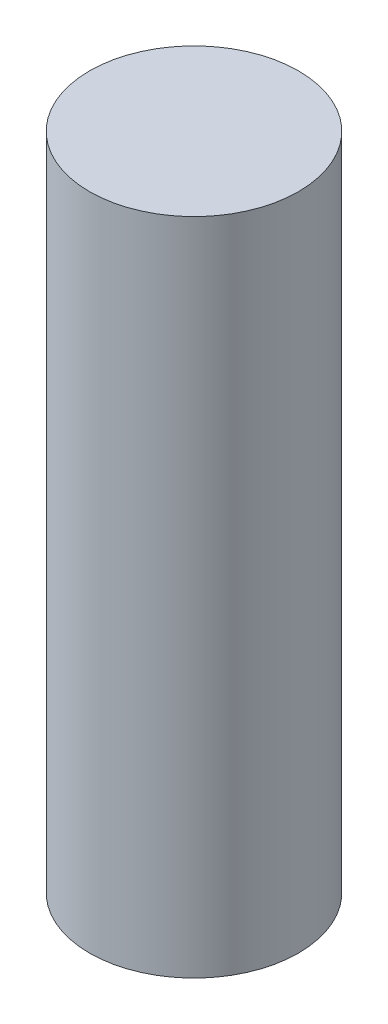
ISO-10303-21;
HEADER;
FILE_DESCRIPTION(('STEP AP214'),'2;1');
FILE_NAME('part.step','',(''),(''),'','','');
FILE_SCHEMA(('AUTOMOTIVE_DESIGN { 1 0 10303 214 1 1 1 1 }'));
ENDSEC;
DATA;
#1=APPLICATION_CONTEXT('core data for automotive mechanical design processes');
#2=APPLICATION_PROTOCOL_DEFINITION('international standard','automotive_design',2000,#1);
#3=PRODUCT_CONTEXT('',#1,'mechanical');
#4=PRODUCT('Part','Part','',(#3));
#5=PRODUCT_RELATED_PRODUCT_CATEGORY('part','',(#4));
#6=PRODUCT_DEFINITION_FORMATION('','',#4);
#7=PRODUCT_DEFINITION_CONTEXT('part definition',#1,'design');
#8=PRODUCT_DEFINITION('design','',#6,#7);
#9=PRODUCT_DEFINITION_SHAPE('','',#8);
#10=(LENGTH_UNIT() NAMED_UNIT(*) SI_UNIT(.MILLI.,.METRE.));
#11=(NAMED_UNIT(*) PLANE_ANGLE_UNIT() SI_UNIT($,.RADIAN.));
#12=(NAMED_UNIT(*) SI_UNIT($,.STERADIAN.) SOLID_ANGLE_UNIT());
#13=UNCERTAINTY_MEASURE_WITH_UNIT(LENGTH_MEASURE(1.E-05),#10,'distance_accuracy_value','');
#14=(GEOMETRIC_REPRESENTATION_CONTEXT(3) GLOBAL_UNCERTAINTY_ASSIGNED_CONTEXT((#13)) GLOBAL_UNIT_ASSIGNED_CONTEXT((#10,
#11,#12)) REPRESENTATION_CONTEXT('',''));
#15=CARTESIAN_POINT('',(0.,0.,0.));
#16=DIRECTION('',(0.,0.,1.));
#17=DIRECTION('',(1.,0.,0.));
#18=AXIS2_PLACEMENT_3D('',#15,#16,#17);
#19=CARTESIAN_POINT('',(0.,-41.,0.));
#20=DIRECTION('',(0.,1.,0.));
#21=DIRECTION('',(0.,0.,1.));
#22=AXIS2_PLACEMENT_3D('',#19,#20,#21);
#23=CYLINDRICAL_SURFACE('',#22,6.5);
#24=CARTESIAN_POINT('',(0.,-41.,0.));
#25=DIRECTION('',(0.,1.,0.));
#26=DIRECTION('',(0.,0.,1.));
#27=AXIS2_PLACEMENT_3D('',#24,#25,#26);
#28=CIRCLE('',#27,6.5);
#29=CARTESIAN_POINT('',(0.,-41.,6.5));
#30=VERTEX_POINT('',#29);
#31=EDGE_CURVE('E10',#30,#30,#28,.T.);
#32=ORIENTED_EDGE('',*,*,#31,.T.);
#33=EDGE_LOOP('',(#32));
#34=FACE_BOUND('',#33,.T.);
#35=CARTESIAN_POINT('',(0.,0.,0.));
#36=DIRECTION('',(0.,1.,0.));
#37=DIRECTION('',(0.,0.,1.));
#38=AXIS2_PLACEMENT_3D('',#35,#36,#37);
#39=CIRCLE('',#38,6.5);
#40=CARTESIAN_POINT('',(0.,0.,6.5));
#41=VERTEX_POINT('',#40);
#42=EDGE_CURVE('E32',#41,#41,#39,.T.);
#43=ORIENTED_EDGE('',*,*,#42,.F.);
#44=EDGE_LOOP('',(#43));
#45=FACE_BOUND('',#44,.T.);
#46=ADVANCED_FACE('F29',(#34,#45),#23,.T.);
#47=CARTESIAN_POINT('',(0.,-41.,0.));
#48=DIRECTION('',(0.,1.,0.));
#49=DIRECTION('',(0.,0.,1.));
#50=AXIS2_PLACEMENT_3D('',#47,#48,#49);
#51=PLANE('',#50);
#52=ORIENTED_EDGE('',*,*,#31,.F.);
#53=EDGE_LOOP('',(#52));
#54=FACE_BOUND('',#53,.T.);
#55=ADVANCED_FACE('F44',(#54),#51,.F.);
#56=CARTESIAN_POINT('',(0.,0.,0.));
#57=DIRECTION('',(0.,1.,0.));
#58=DIRECTION('',(0.,0.,1.));
#59=AXIS2_PLACEMENT_3D('',#56,#57,#58);
#60=PLANE('',#59);
#61=ORIENTED_EDGE('',*,*,#42,.T.);
#62=EDGE_LOOP('',(#61));
#63=FACE_BOUND('',#62,.T.);
#64=ADVANCED_FACE('F41',(#63),#60,.T.);
#65=CLOSED_SHELL('',(#46,#55,#64));
#66=MANIFOLD_SOLID_BREP('B2',#65);
#67=ADVANCED_BREP_SHAPE_REPRESENTATION('',(#18,#66),#14);
#68=SHAPE_DEFINITION_REPRESENTATION(#9,#67);
ENDSEC;
END-ISO-10303-21;
